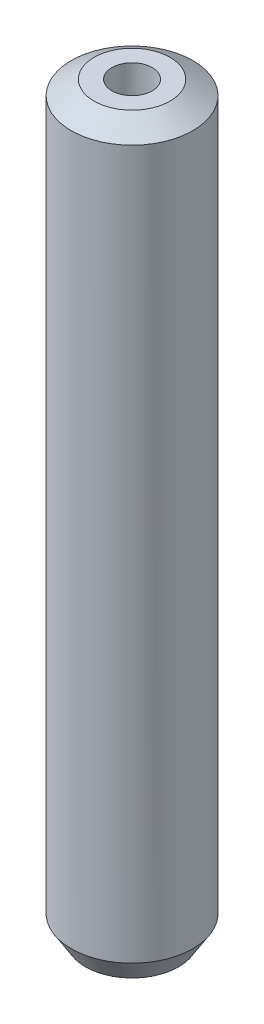
ISO-10303-21;
HEADER;
FILE_DESCRIPTION(('STEP AP214'),'2;1');
FILE_NAME('part.step','',(''),(''),'','','');
FILE_SCHEMA(('AUTOMOTIVE_DESIGN { 1 0 10303 214 1 1 1 1 }'));
ENDSEC;
DATA;
#1=APPLICATION_CONTEXT('core data for automotive mechanical design processes');
#2=APPLICATION_PROTOCOL_DEFINITION('international standard','automotive_design',2000,#1);
#3=PRODUCT_CONTEXT('',#1,'mechanical');
#4=PRODUCT('Part','Part','',(#3));
#5=PRODUCT_RELATED_PRODUCT_CATEGORY('part','',(#4));
#6=PRODUCT_DEFINITION_FORMATION('','',#4);
#7=PRODUCT_DEFINITION_CONTEXT('part definition',#1,'design');
#8=PRODUCT_DEFINITION('design','',#6,#7);
#9=PRODUCT_DEFINITION_SHAPE('','',#8);
#10=(LENGTH_UNIT() NAMED_UNIT(*) SI_UNIT(.MILLI.,.METRE.));
#11=(NAMED_UNIT(*) PLANE_ANGLE_UNIT() SI_UNIT($,.RADIAN.));
#12=(NAMED_UNIT(*) SI_UNIT($,.STERADIAN.) SOLID_ANGLE_UNIT());
#13=UNCERTAINTY_MEASURE_WITH_UNIT(LENGTH_MEASURE(1.E-05),#10,'distance_accuracy_value','');
#14=(GEOMETRIC_REPRESENTATION_CONTEXT(3) GLOBAL_UNCERTAINTY_ASSIGNED_CONTEXT((#13)) GLOBAL_UNIT_ASSIGNED_CONTEXT((#10,
#11,#12)) REPRESENTATION_CONTEXT('',''));
#15=CARTESIAN_POINT('',(0.,0.,0.));
#16=DIRECTION('',(0.,0.,1.));
#17=DIRECTION('',(1.,0.,0.));
#18=AXIS2_PLACEMENT_3D('',#15,#16,#17);
#19=CARTESIAN_POINT('',(0.,153.273178210205,0.));
#20=DIRECTION('',(0.,-1.,0.));
#21=DIRECTION('',(0.,0.,-1.));
#22=AXIS2_PLACEMENT_3D('',#19,#20,#21);
#23=CYLINDRICAL_SURFACE('',#22,12.5);
#24=CARTESIAN_POINT('',(0.,150.358117367055,0.));
#25=DIRECTION('',(0.,1.,0.));
#26=DIRECTION('',(0.,0.,1.));
#27=AXIS2_PLACEMENT_3D('',#24,#25,#26);
#28=CIRCLE('',#27,12.5);
#29=CARTESIAN_POINT('',(0.,150.358117367055,-12.5));
#30=VERTEX_POINT('',#29);
#31=EDGE_CURVE('E50',#30,#30,#28,.F.);
#32=ORIENTED_EDGE('',*,*,#31,.T.);
#33=EDGE_LOOP('',(#32));
#34=FACE_BOUND('',#33,.T.);
#35=CARTESIAN_POINT('',(0.,4.69385032341449,0.));
#36=DIRECTION('',(0.,1.,0.));
#37=DIRECTION('',(0.,0.,1.));
#38=AXIS2_PLACEMENT_3D('',#35,#36,#37);
#39=CIRCLE('',#38,12.5);
#40=CARTESIAN_POINT('',(0.,4.69385032341449,12.5));
#41=VERTEX_POINT('',#40);
#42=EDGE_CURVE('E51',#41,#41,#39,.T.);
#43=ORIENTED_EDGE('',*,*,#42,.T.);
#44=EDGE_LOOP('',(#43));
#45=FACE_BOUND('',#44,.T.);
#46=ADVANCED_FACE('F39',(#34,#45),#23,.T.);
#47=CARTESIAN_POINT('',(0.,153.273178210205,0.));
#48=DIRECTION('',(0.,1.,0.));
#49=DIRECTION('',(0.,0.,1.));
#50=AXIS2_PLACEMENT_3D('',#47,#48,#49);
#51=PLANE('',#50);
#52=CARTESIAN_POINT('',(0.,153.273178210205,0.));
#53=DIRECTION('',(0.,1.,0.));
#54=DIRECTION('',(0.,0.,1.));
#55=AXIS2_PLACEMENT_3D('',#52,#53,#54);
#56=CIRCLE('',#55,7.8061496765856);
#57=CARTESIAN_POINT('',(0.,153.273178210205,-7.80614967658563));
#58=VERTEX_POINT('',#57);
#59=EDGE_CURVE('E54',#58,#58,#56,.T.);
#60=ORIENTED_EDGE('',*,*,#59,.T.);
#61=EDGE_LOOP('',(#60));
#62=FACE_BOUND('',#61,.T.);
#63=CARTESIAN_POINT('',(0.,153.273178210205,0.));
#64=DIRECTION('',(0.,1.,0.));
#65=DIRECTION('',(0.,0.,1.));
#66=AXIS2_PLACEMENT_3D('',#63,#64,#65);
#67=CIRCLE('',#66,4.14428136849778);
#68=CARTESIAN_POINT('',(0.,153.273178210205,4.14428136849778));
#69=VERTEX_POINT('',#68);
#70=EDGE_CURVE('E58',#69,#69,#67,.T.);
#71=ORIENTED_EDGE('',*,*,#70,.F.);
#72=EDGE_LOOP('',(#71));
#73=FACE_BOUND('',#72,.T.);
#74=ADVANCED_FACE('F69',(#62,#73),#51,.T.);
#75=CARTESIAN_POINT('',(0.,0.,0.));
#76=DIRECTION('',(0.,1.,0.));
#77=DIRECTION('',(0.,0.,1.));
#78=AXIS2_PLACEMENT_3D('',#75,#76,#77);
#79=PLANE('',#78);
#80=CARTESIAN_POINT('',(0.,0.,0.));
#81=DIRECTION('',(0.,1.,0.));
#82=DIRECTION('',(0.,0.,1.));
#83=AXIS2_PLACEMENT_3D('',#80,#81,#82);
#84=CIRCLE('',#83,9.58493915685038);
#85=CARTESIAN_POINT('',(0.,0.,9.58493915685038));
#86=VERTEX_POINT('',#85);
#87=EDGE_CURVE('E10',#86,#86,#84,.F.);
#88=ORIENTED_EDGE('',*,*,#87,.T.);
#89=EDGE_LOOP('',(#88));
#90=FACE_BOUND('',#89,.T.);
#91=CARTESIAN_POINT('',(0.,0.,0.));
#92=DIRECTION('',(0.,1.,0.));
#93=DIRECTION('',(0.,0.,1.));
#94=AXIS2_PLACEMENT_3D('',#91,#92,#93);
#95=CIRCLE('',#94,4.14428136849778);
#96=CARTESIAN_POINT('',(0.,0.,4.14428136849778));
#97=VERTEX_POINT('',#96);
#98=EDGE_CURVE('E63',#97,#97,#95,.T.);
#99=ORIENTED_EDGE('',*,*,#98,.T.);
#100=EDGE_LOOP('',(#99));
#101=FACE_BOUND('',#100,.T.);
#102=ADVANCED_FACE('F75',(#90,#101),#79,.F.);
#103=CARTESIAN_POINT('',(0.,153.273178210205,0.));
#104=DIRECTION('',(0.,-1.,0.));
#105=DIRECTION('',(0.,0.,-1.));
#106=AXIS2_PLACEMENT_3D('',#103,#104,#105);
#107=CYLINDRICAL_SURFACE('',#106,4.14428136849778);
#108=ORIENTED_EDGE('',*,*,#70,.T.);
#109=EDGE_LOOP('',(#108));
#110=FACE_BOUND('',#109,.T.);
#111=ORIENTED_EDGE('',*,*,#98,.F.);
#112=EDGE_LOOP('',(#111));
#113=FACE_BOUND('',#112,.T.);
#114=ADVANCED_FACE('F70',(#110,#113),#107,.F.);
#115=CARTESIAN_POINT('',(0.,153.273178210205,0.));
#116=DIRECTION('',(0.,-1.,0.));
#117=DIRECTION('',(0.,0.,-1.));
#118=AXIS2_PLACEMENT_3D('',#115,#116,#117);
#119=CONICAL_SURFACE('',#118,7.8061496765856,1.01505094544153);
#120=CARTESIAN_POINT('',(0.,150.358117367055,-12.5));
#121=CARTESIAN_POINT('',(0.,150.388482584171,-12.4511057257978));
#122=CARTESIAN_POINT('',(0.,150.418847801287,-12.4022114515956));
#123=CARTESIAN_POINT('',(0.,150.47957823552,-12.3044229031911));
#124=CARTESIAN_POINT('',(0.,150.509943452636,-12.2555286289889));
#125=CARTESIAN_POINT('',(0.,150.570673886868,-12.1577400805844));
#126=CARTESIAN_POINT('',(0.,150.601039103984,-12.1088458063822));
#127=CARTESIAN_POINT('',(0.,150.661769538217,-12.0110572579777));
#128=CARTESIAN_POINT('',(0.,150.692134755333,-11.9621629837755));
#129=CARTESIAN_POINT('',(0.,150.752865189565,-11.864374435371));
#130=CARTESIAN_POINT('',(0.,150.783230406681,-11.8154801611688));
#131=CARTESIAN_POINT('',(0.,150.843960840913,-11.7176916127643));
#132=CARTESIAN_POINT('',(0.,150.87432605803,-11.6687973385621));
#133=CARTESIAN_POINT('',(0.,150.935056492262,-11.5710087901576));
#134=CARTESIAN_POINT('',(0.,150.965421709378,-11.5221145159554));
#135=CARTESIAN_POINT('',(0.,151.02615214361,-11.4243259675509));
#136=CARTESIAN_POINT('',(0.,151.056517360726,-11.3754316933487));
#137=CARTESIAN_POINT('',(0.,151.117247794959,-11.2776431449442));
#138=CARTESIAN_POINT('',(0.,151.147613012075,-11.228748870742));
#139=CARTESIAN_POINT('',(0.,151.208343446307,-11.1309603223375));
#140=CARTESIAN_POINT('',(0.,151.238708663423,-11.0820660481353));
#141=CARTESIAN_POINT('',(0.,151.299439097656,-10.9842774997308));
#142=CARTESIAN_POINT('',(0.,151.329804314772,-10.9353832255286));
#143=CARTESIAN_POINT('',(0.,151.390534749004,-10.8375946771241));
#144=CARTESIAN_POINT('',(0.,151.42089996612,-10.7887004029219));
#145=CARTESIAN_POINT('',(0.,151.481630400352,-10.6909118545174));
#146=CARTESIAN_POINT('',(0.,151.511995617469,-10.6420175803152));
#147=CARTESIAN_POINT('',(0.,151.572726051701,-10.5442290319107));
#148=CARTESIAN_POINT('',(0.,151.603091268817,-10.4953347577085));
#149=CARTESIAN_POINT('',(0.,151.663821703049,-10.397546209304));
#150=CARTESIAN_POINT('',(0.,151.694186920165,-10.3486519351018));
#151=CARTESIAN_POINT('',(0.,151.754917354398,-10.2508633866973));
#152=CARTESIAN_POINT('',(0.,151.785282571514,-10.2019691124951));
#153=CARTESIAN_POINT('',(0.,151.846013005746,-10.1041805640906));
#154=CARTESIAN_POINT('',(0.,151.876378222862,-10.0552862898884));
#155=CARTESIAN_POINT('',(0.,151.937108657095,-9.95749774148389));
#156=CARTESIAN_POINT('',(0.,151.967473874211,-9.90860346728166));
#157=CARTESIAN_POINT('',(0.,152.028204308443,-9.81081491887719));
#158=CARTESIAN_POINT('',(0.,152.058569525559,-9.76192064467496));
#159=CARTESIAN_POINT('',(0.,152.119299959791,-9.66413209627049));
#160=CARTESIAN_POINT('',(0.,152.149665176908,-9.61523782206826));
#161=CARTESIAN_POINT('',(0.,152.21039561114,-9.51744927366379));
#162=CARTESIAN_POINT('',(0.,152.240760828256,-9.46855499946156));
#163=CARTESIAN_POINT('',(0.,152.301491262488,-9.37076645105709));
#164=CARTESIAN_POINT('',(0.,152.331856479604,-9.32187217685486));
#165=CARTESIAN_POINT('',(0.,152.392586913837,-9.22408362845039));
#166=CARTESIAN_POINT('',(0.,152.422952130953,-9.17518935424816));
#167=CARTESIAN_POINT('',(0.,152.483682565185,-9.07740080584369));
#168=CARTESIAN_POINT('',(0.,152.514047782301,-9.02850653164146));
#169=CARTESIAN_POINT('',(0.,152.574778216533,-8.93071798323699));
#170=CARTESIAN_POINT('',(0.,152.60514343365,-8.88182370903476));
#171=CARTESIAN_POINT('',(0.,152.665873867882,-8.7840351606303));
#172=CARTESIAN_POINT('',(0.,152.696239084998,-8.73514088642806));
#173=CARTESIAN_POINT('',(0.,152.75696951923,-8.63735233802359));
#174=CARTESIAN_POINT('',(0.,152.787334736346,-8.58845806382136));
#175=CARTESIAN_POINT('',(0.,152.848065170579,-8.49066951541689));
#176=CARTESIAN_POINT('',(0.,152.878430387695,-8.44177524121466));
#177=CARTESIAN_POINT('',(0.,152.939160821927,-8.34398669281019));
#178=CARTESIAN_POINT('',(0.,152.969526039043,-8.29509241860796));
#179=CARTESIAN_POINT('',(0.,153.030256473276,-8.19730387020349));
#180=CARTESIAN_POINT('',(0.,153.060621690392,-8.14840959600126));
#181=CARTESIAN_POINT('',(0.,153.121352124624,-8.05062104759679));
#182=CARTESIAN_POINT('',(0.,153.15171734174,-8.00172677339456));
#183=CARTESIAN_POINT('',(0.,153.212447775972,-7.9039382249901));
#184=CARTESIAN_POINT('',(0.,153.242812993089,-7.85504395078786));
#185=CARTESIAN_POINT('',(0.,153.273178210205,-7.80614967658563));
#186=B_SPLINE_CURVE_WITH_KNOTS('',3,(#120,#121,#122,#123,#124,#125,#126,#127,#128,#129,#130,
#131,#132,#133,#134,#135,#136,#137,#138,#139,#140,#141,#142,#143,#144,#145,#146,#147,#148,#149,
#150,#151,#152,#153,#154,#155,#156,#157,#158,#159,#160,#161,#162,#163,#164,#165,#166,#167,#168,
#169,#170,#171,#172,#173,#174,#175,#176,#177,#178,#179,#180,#181,#182,#183,#184,#185),
.UNSPECIFIED.,.F.,.F.,(4,2,2,2,2,2,2,2,2,2,2,2,2,2,2,2,2,2,2,2,2,2,2,2,2,2,2,2,2,2,2,2,4),(0.,
0.172668086635772,0.345336173271559,0.518004259907331,0.690672346543119,0.863340433178907,
1.03600851981468,1.20867660645047,1.38134469308626,1.55401277972203,1.72668086635782,
1.8993489529936,2.07201703962938,2.24468512626516,2.41735321290095,2.59002129953672,
2.76268938617251,2.9353574728083,3.10802555944407,3.28069364607986,3.45336173271565,
3.62602981935142,3.79869790598721,3.971365992623,4.14403407925877,4.31670216589455,
4.48937025253034,4.66203833916612,4.8347064258019,5.00737451243769,5.18004259907346,
5.35271068570925,5.52537877234504),.UNSPECIFIED.);
#187=EDGE_CURVE('BSEAM81',#30,#58,#186,.T.);
#188=ORIENTED_EDGE('',*,*,#31,.F.);
#189=ORIENTED_EDGE('',*,*,#59,.F.);
#190=ORIENTED_EDGE('',*,*,#187,.T.);
#191=ORIENTED_EDGE('',*,*,#187,.F.);
#192=EDGE_LOOP('',(#188,#190,#189,#191));
#193=FACE_BOUND('',#192,.T.);
#194=ADVANCED_FACE('F81',(#193),#119,.T.);
#195=CARTESIAN_POINT('',(0.,4.69385032341449,0.));
#196=DIRECTION('',(0.,1.,0.));
#197=DIRECTION('',(0.,0.,1.));
#198=AXIS2_PLACEMENT_3D('',#195,#196,#197);
#199=CONICAL_SURFACE('',#198,12.5,0.55574538135337);
#200=ORIENTED_EDGE('',*,*,#87,.F.);
#201=EDGE_LOOP('',(#200));
#202=FACE_BOUND('',#201,.T.);
#203=ORIENTED_EDGE('',*,*,#42,.F.);
#204=EDGE_LOOP('',(#203));
#205=FACE_BOUND('',#204,.T.);
#206=ADVANCED_FACE('F45',(#202,#205),#199,.T.);
#207=CLOSED_SHELL('',(#46,#74,#102,#114,#194,#206));
#208=MANIFOLD_SOLID_BREP('B2',#207);
#209=ADVANCED_BREP_SHAPE_REPRESENTATION('',(#18,#208),#14);
#210=SHAPE_DEFINITION_REPRESENTATION(#9,#209);
ENDSEC;
END-ISO-10303-21;
